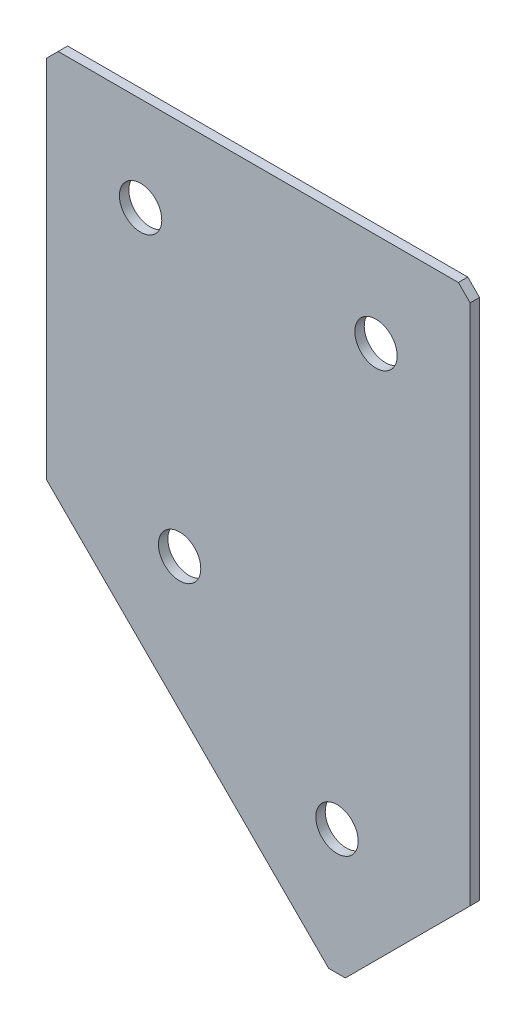
ISO-10303-21;
HEADER;
FILE_DESCRIPTION(('STEP AP214'),'2;1');
FILE_NAME('part.step','',(''),(''),'','','');
FILE_SCHEMA(('AUTOMOTIVE_DESIGN { 1 0 10303 214 1 1 1 1 }'));
ENDSEC;
DATA;
#1=APPLICATION_CONTEXT('core data for automotive mechanical design processes');
#2=APPLICATION_PROTOCOL_DEFINITION('international standard','automotive_design',2000,#1);
#3=PRODUCT_CONTEXT('',#1,'mechanical');
#4=PRODUCT('Part','Part','',(#3));
#5=PRODUCT_RELATED_PRODUCT_CATEGORY('part','',(#4));
#6=PRODUCT_DEFINITION_FORMATION('','',#4);
#7=PRODUCT_DEFINITION_CONTEXT('part definition',#1,'design');
#8=PRODUCT_DEFINITION('design','',#6,#7);
#9=PRODUCT_DEFINITION_SHAPE('','',#8);
#10=(LENGTH_UNIT() NAMED_UNIT(*) SI_UNIT(.MILLI.,.METRE.));
#11=(NAMED_UNIT(*) PLANE_ANGLE_UNIT() SI_UNIT($,.RADIAN.));
#12=(NAMED_UNIT(*) SI_UNIT($,.STERADIAN.) SOLID_ANGLE_UNIT());
#13=UNCERTAINTY_MEASURE_WITH_UNIT(LENGTH_MEASURE(1.E-05),#10,'distance_accuracy_value','');
#14=(GEOMETRIC_REPRESENTATION_CONTEXT(3) GLOBAL_UNCERTAINTY_ASSIGNED_CONTEXT((#13)) GLOBAL_UNIT_ASSIGNED_CONTEXT((#10,
#11,#12)) REPRESENTATION_CONTEXT('',''));
#15=CARTESIAN_POINT('',(0.,0.,0.));
#16=DIRECTION('',(0.,0.,1.));
#17=DIRECTION('',(1.,0.,0.));
#18=AXIS2_PLACEMENT_3D('',#15,#16,#17);
#19=CARTESIAN_POINT('',(0.,0.,-2.));
#20=DIRECTION('',(1.,0.,0.));
#21=DIRECTION('',(0.,0.,-1.));
#22=AXIS2_PLACEMENT_3D('',#19,#20,#21);
#23=PLANE('',#22);
#24=DIRECTION('',(0.,1.,0.));
#25=VECTOR('',#24,1.);
#26=CARTESIAN_POINT('',(0.,0.,0.));
#27=LINE('',#26,#25);
#28=CARTESIAN_POINT('',(0.,-80.,0.));
#29=VERTEX_POINT('',#28);
#30=CARTESIAN_POINT('',(0.,-2.5,0.));
#31=VERTEX_POINT('',#30);
#32=EDGE_CURVE('E137',#29,#31,#27,.T.);
#33=ORIENTED_EDGE('',*,*,#32,.T.);
#34=DIRECTION('',(0.,0.,-1.));
#35=VECTOR('',#34,1.);
#36=CARTESIAN_POINT('',(0.,-2.5,-2.));
#37=LINE('',#36,#35);
#38=CARTESIAN_POINT('',(0.,-2.5,-2.));
#39=VERTEX_POINT('',#38);
#40=EDGE_CURVE('E11',#31,#39,#37,.T.);
#41=ORIENTED_EDGE('',*,*,#40,.T.);
#42=DIRECTION('',(0.,1.,0.));
#43=VECTOR('',#42,1.);
#44=CARTESIAN_POINT('',(0.,0.,-2.));
#45=LINE('',#44,#43);
#46=CARTESIAN_POINT('',(0.,-80.,-2.));
#47=VERTEX_POINT('',#46);
#48=EDGE_CURVE('E153',#47,#39,#45,.T.);
#49=ORIENTED_EDGE('',*,*,#48,.F.);
#50=DIRECTION('',(0.,0.,1.));
#51=VECTOR('',#50,1.);
#52=CARTESIAN_POINT('',(0.,-80.,-2.));
#53=LINE('',#52,#51);
#54=EDGE_CURVE('E125',#47,#29,#53,.T.);
#55=ORIENTED_EDGE('',*,*,#54,.T.);
#56=EDGE_LOOP('',(#33,#41,#49,#55));
#57=FACE_BOUND('',#56,.T.);
#58=ADVANCED_FACE('F39',(#57),#23,.F.);
#59=CARTESIAN_POINT('',(0.,0.,-2.));
#60=DIRECTION('',(0.,-1.,0.));
#61=DIRECTION('',(0.,0.,-1.));
#62=AXIS2_PLACEMENT_3D('',#59,#60,#61);
#63=PLANE('',#62);
#64=DIRECTION('',(1.,0.,0.));
#65=VECTOR('',#64,1.);
#66=CARTESIAN_POINT('',(0.,0.,0.));
#67=LINE('',#66,#65);
#68=CARTESIAN_POINT('',(2.5,0.,0.));
#69=VERTEX_POINT('',#68);
#70=CARTESIAN_POINT('',(87.5,0.,0.));
#71=VERTEX_POINT('',#70);
#72=EDGE_CURVE('E141',#69,#71,#67,.T.);
#73=ORIENTED_EDGE('',*,*,#72,.T.);
#74=DIRECTION('',(0.,0.,-1.));
#75=VECTOR('',#74,1.);
#76=CARTESIAN_POINT('',(87.5,0.,-2.));
#77=LINE('',#76,#75);
#78=CARTESIAN_POINT('',(87.5,0.,-2.));
#79=VERTEX_POINT('',#78);
#80=EDGE_CURVE('E48',#71,#79,#77,.T.);
#81=ORIENTED_EDGE('',*,*,#80,.T.);
#82=DIRECTION('',(1.,0.,0.));
#83=VECTOR('',#82,1.);
#84=CARTESIAN_POINT('',(0.,0.,-2.));
#85=LINE('',#84,#83);
#86=CARTESIAN_POINT('',(2.5,0.,-2.));
#87=VERTEX_POINT('',#86);
#88=EDGE_CURVE('E113',#87,#79,#85,.T.);
#89=ORIENTED_EDGE('',*,*,#88,.F.);
#90=DIRECTION('',(0.,0.,1.));
#91=VECTOR('',#90,1.);
#92=CARTESIAN_POINT('',(2.5,0.,-2.));
#93=LINE('',#92,#91);
#94=EDGE_CURVE('E182',#87,#69,#93,.T.);
#95=ORIENTED_EDGE('',*,*,#94,.T.);
#96=EDGE_LOOP('',(#73,#81,#89,#95));
#97=FACE_BOUND('',#96,.T.);
#98=ADVANCED_FACE('F188',(#97),#63,.F.);
#99=CARTESIAN_POINT('',(90.,0.,-2.));
#100=DIRECTION('',(-1.,0.,0.));
#101=DIRECTION('',(0.,-1.,0.));
#102=AXIS2_PLACEMENT_3D('',#99,#100,#101);
#103=PLANE('',#102);
#104=DIRECTION('',(0.,-1.,0.));
#105=VECTOR('',#104,1.);
#106=CARTESIAN_POINT('',(90.,0.,-2.));
#107=LINE('',#106,#105);
#108=CARTESIAN_POINT('',(90.,-2.50000000000002,-2.));
#109=VERTEX_POINT('',#108);
#110=CARTESIAN_POINT('',(90.0000000000002,-113.431457505077,-2.));
#111=VERTEX_POINT('',#110);
#112=EDGE_CURVE('E103',#109,#111,#107,.T.);
#113=ORIENTED_EDGE('',*,*,#112,.F.);
#114=DIRECTION('',(0.,0.,1.));
#115=VECTOR('',#114,1.);
#116=CARTESIAN_POINT('',(90.,-2.50000000000002,-2.));
#117=LINE('',#116,#115);
#118=CARTESIAN_POINT('',(90.,-2.50000000000002,0.));
#119=VERTEX_POINT('',#118);
#120=EDGE_CURVE('E179',#109,#119,#117,.T.);
#121=ORIENTED_EDGE('',*,*,#120,.T.);
#122=DIRECTION('',(0.,-1.,0.));
#123=VECTOR('',#122,1.);
#124=CARTESIAN_POINT('',(90.,0.,0.));
#125=LINE('',#124,#123);
#126=CARTESIAN_POINT('',(90.0000000000002,-113.431457505077,0.));
#127=VERTEX_POINT('',#126);
#128=EDGE_CURVE('E119',#119,#127,#125,.T.);
#129=ORIENTED_EDGE('',*,*,#128,.T.);
#130=DIRECTION('',(0.,0.,1.));
#131=VECTOR('',#130,1.);
#132=CARTESIAN_POINT('',(90.0000000000002,-113.431457505077,-2.));
#133=LINE('',#132,#131);
#134=EDGE_CURVE('E116',#111,#127,#133,.T.);
#135=ORIENTED_EDGE('',*,*,#134,.F.);
#136=EDGE_LOOP('',(#113,#121,#129,#135));
#137=FACE_BOUND('',#136,.T.);
#138=ADVANCED_FACE('F117',(#137),#103,.F.);
#139=CARTESIAN_POINT('',(61.7157287525382,-141.715728752538,-2.));
#140=DIRECTION('',(-0.707106781186546,0.707106781186549,0.));
#141=DIRECTION('',(-0.707106781186549,-0.707106781186546,0.));
#142=AXIS2_PLACEMENT_3D('',#139,#140,#141);
#143=PLANE('',#142);
#144=DIRECTION('',(-0.707106781186549,-0.707106781186546,0.));
#145=VECTOR('',#144,1.);
#146=CARTESIAN_POINT('',(61.7157287525382,-141.715728752538,0.));
#147=LINE('',#146,#145);
#148=CARTESIAN_POINT('',(63.4834957055046,-139.947961799572,0.));
#149=VERTEX_POINT('',#148);
#150=EDGE_CURVE('E147',#127,#149,#147,.T.);
#151=ORIENTED_EDGE('',*,*,#150,.T.);
#152=DIRECTION('',(0.,0.,-1.));
#153=VECTOR('',#152,1.);
#154=CARTESIAN_POINT('',(63.4834957055046,-139.947961799572,-2.));
#155=LINE('',#154,#153);
#156=CARTESIAN_POINT('',(63.4834957055046,-139.947961799572,-2.));
#157=VERTEX_POINT('',#156);
#158=EDGE_CURVE('E129',#149,#157,#155,.T.);
#159=ORIENTED_EDGE('',*,*,#158,.T.);
#160=DIRECTION('',(-0.707106781186549,-0.707106781186546,0.));
#161=VECTOR('',#160,1.);
#162=CARTESIAN_POINT('',(61.7157287525382,-141.715728752538,-2.));
#163=LINE('',#162,#161);
#164=EDGE_CURVE('E107',#111,#157,#163,.T.);
#165=ORIENTED_EDGE('',*,*,#164,.F.);
#166=ORIENTED_EDGE('',*,*,#134,.T.);
#167=EDGE_LOOP('',(#151,#159,#165,#166));
#168=FACE_BOUND('',#167,.T.);
#169=ADVANCED_FACE('F127',(#168),#143,.F.);
#170=CARTESIAN_POINT('',(0.,-80.,-2.));
#171=DIRECTION('',(0.707106781186549,0.707106781186546,0.));
#172=DIRECTION('',(-0.707106781186546,0.707106781186549,0.));
#173=AXIS2_PLACEMENT_3D('',#170,#171,#172);
#174=PLANE('',#173);
#175=DIRECTION('',(-0.707106781186546,0.707106781186549,0.));
#176=VECTOR('',#175,1.);
#177=CARTESIAN_POINT('',(0.,-80.,-2.));
#178=LINE('',#177,#176);
#179=CARTESIAN_POINT('',(59.9479617995719,-139.947961799572,-2.));
#180=VERTEX_POINT('',#179);
#181=EDGE_CURVE('E131',#180,#47,#178,.T.);
#182=ORIENTED_EDGE('',*,*,#181,.F.);
#183=DIRECTION('',(0.,0.,1.));
#184=VECTOR('',#183,1.);
#185=CARTESIAN_POINT('',(59.9479617995719,-139.947961799572,-2.));
#186=LINE('',#185,#184);
#187=CARTESIAN_POINT('',(59.9479617995719,-139.947961799572,0.));
#188=VERTEX_POINT('',#187);
#189=EDGE_CURVE('E124',#180,#188,#186,.T.);
#190=ORIENTED_EDGE('',*,*,#189,.T.);
#191=DIRECTION('',(-0.707106781186546,0.707106781186549,0.));
#192=VECTOR('',#191,1.);
#193=CARTESIAN_POINT('',(0.,-80.,0.));
#194=LINE('',#193,#192);
#195=EDGE_CURVE('E150',#188,#29,#194,.T.);
#196=ORIENTED_EDGE('',*,*,#195,.T.);
#197=ORIENTED_EDGE('',*,*,#54,.F.);
#198=EDGE_LOOP('',(#182,#190,#196,#197));
#199=FACE_BOUND('',#198,.T.);
#200=ADVANCED_FACE('F218',(#199),#174,.F.);
#201=CARTESIAN_POINT('',(0.,0.,-2.));
#202=DIRECTION('',(0.,0.,1.));
#203=DIRECTION('',(1.,0.,0.));
#204=AXIS2_PLACEMENT_3D('',#201,#202,#203);
#205=PLANE('',#204);
#206=CARTESIAN_POINT('',(70.,-20.,-2.));
#207=DIRECTION('',(0.,0.,-1.));
#208=DIRECTION('',(0.,1.,0.));
#209=AXIS2_PLACEMENT_3D('',#206,#207,#208);
#210=CIRCLE('',#209,4.5);
#211=CARTESIAN_POINT('',(70.,-15.5,-2.));
#212=VERTEX_POINT('',#211);
#213=EDGE_CURVE('E250',#212,#212,#210,.T.);
#214=ORIENTED_EDGE('',*,*,#213,.F.);
#215=EDGE_LOOP('',(#214));
#216=FACE_BOUND('',#215,.T.);
#217=CARTESIAN_POINT('',(28.2842712474619,-80.0000000000002,-2.));
#218=DIRECTION('',(0.,0.,-1.));
#219=DIRECTION('',(0.,1.,0.));
#220=AXIS2_PLACEMENT_3D('',#217,#218,#219);
#221=CIRCLE('',#220,4.5);
#222=CARTESIAN_POINT('',(28.2842712474619,-75.5000000000002,-2.));
#223=VERTEX_POINT('',#222);
#224=EDGE_CURVE('E254',#223,#223,#221,.T.);
#225=ORIENTED_EDGE('',*,*,#224,.F.);
#226=EDGE_LOOP('',(#225));
#227=FACE_BOUND('',#226,.T.);
#228=CARTESIAN_POINT('',(61.7157287525383,-113.431457505077,-2.00000000000001));
#229=DIRECTION('',(0.,0.,-1.));
#230=DIRECTION('',(0.,1.,0.));
#231=AXIS2_PLACEMENT_3D('',#228,#229,#230);
#232=CIRCLE('',#231,4.5);
#233=CARTESIAN_POINT('',(61.7157287525383,-108.931457505077,-2.00000000000001));
#234=VERTEX_POINT('',#233);
#235=EDGE_CURVE('E264',#234,#234,#232,.T.);
#236=ORIENTED_EDGE('',*,*,#235,.F.);
#237=EDGE_LOOP('',(#236));
#238=FACE_BOUND('',#237,.T.);
#239=CARTESIAN_POINT('',(20.,-20.,-2.));
#240=DIRECTION('',(0.,0.,-1.));
#241=DIRECTION('',(0.,1.,0.));
#242=AXIS2_PLACEMENT_3D('',#239,#240,#241);
#243=CIRCLE('',#242,4.5);
#244=CARTESIAN_POINT('',(20.,-15.5,-2.));
#245=VERTEX_POINT('',#244);
#246=EDGE_CURVE('E272',#245,#245,#243,.T.);
#247=ORIENTED_EDGE('',*,*,#246,.F.);
#248=EDGE_LOOP('',(#247));
#249=FACE_BOUND('',#248,.T.);
#250=ORIENTED_EDGE('',*,*,#164,.T.);
#251=DIRECTION('',(1.,0.,0.));
#252=VECTOR('',#251,1.);
#253=CARTESIAN_POINT('',(59.9479617995719,-139.947961799572,-2.));
#254=LINE('',#253,#252);
#255=EDGE_CURVE('E176',#157,#180,#254,.F.);
#256=ORIENTED_EDGE('',*,*,#255,.T.);
#257=ORIENTED_EDGE('',*,*,#181,.T.);
#258=ORIENTED_EDGE('',*,*,#48,.T.);
#259=DIRECTION('',(-0.707106781186548,-0.707106781186548,0.));
#260=VECTOR('',#259,1.);
#261=CARTESIAN_POINT('',(2.5,0.,-2.));
#262=LINE('',#261,#260);
#263=EDGE_CURVE('E171',#39,#87,#262,.F.);
#264=ORIENTED_EDGE('',*,*,#263,.T.);
#265=ORIENTED_EDGE('',*,*,#88,.T.);
#266=DIRECTION('',(-0.707106781186548,0.707106781186548,0.));
#267=VECTOR('',#266,1.);
#268=CARTESIAN_POINT('',(90.,-2.50000000000002,-2.));
#269=LINE('',#268,#267);
#270=EDGE_CURVE('E55',#79,#109,#269,.F.);
#271=ORIENTED_EDGE('',*,*,#270,.T.);
#272=ORIENTED_EDGE('',*,*,#112,.T.);
#273=EDGE_LOOP('',(#250,#256,#257,#258,#264,#265,#271,#272));
#274=FACE_BOUND('',#273,.T.);
#275=ADVANCED_FACE('F105',(#216,#227,#238,#249,#274),#205,.F.);
#276=CARTESIAN_POINT('',(0.,0.,0.));
#277=DIRECTION('',(0.,0.,1.));
#278=DIRECTION('',(1.,0.,0.));
#279=AXIS2_PLACEMENT_3D('',#276,#277,#278);
#280=PLANE('',#279);
#281=CARTESIAN_POINT('',(70.,-20.,0.));
#282=DIRECTION('',(0.,0.,-1.));
#283=DIRECTION('',(0.,1.,0.));
#284=AXIS2_PLACEMENT_3D('',#281,#282,#283);
#285=CIRCLE('',#284,4.5);
#286=CARTESIAN_POINT('',(70.,-15.5,0.));
#287=VERTEX_POINT('',#286);
#288=EDGE_CURVE('E247',#287,#287,#285,.T.);
#289=ORIENTED_EDGE('',*,*,#288,.T.);
#290=EDGE_LOOP('',(#289));
#291=FACE_BOUND('',#290,.T.);
#292=CARTESIAN_POINT('',(28.2842712474619,-80.0000000000002,0.));
#293=DIRECTION('',(0.,0.,-1.));
#294=DIRECTION('',(0.,1.,0.));
#295=AXIS2_PLACEMENT_3D('',#292,#293,#294);
#296=CIRCLE('',#295,4.5);
#297=CARTESIAN_POINT('',(28.2842712474619,-75.5000000000002,0.));
#298=VERTEX_POINT('',#297);
#299=EDGE_CURVE('E260',#298,#298,#296,.T.);
#300=ORIENTED_EDGE('',*,*,#299,.T.);
#301=EDGE_LOOP('',(#300));
#302=FACE_BOUND('',#301,.T.);
#303=CARTESIAN_POINT('',(61.7157287525383,-113.431457505077,0.));
#304=DIRECTION('',(0.,0.,-1.));
#305=DIRECTION('',(0.,1.,0.));
#306=AXIS2_PLACEMENT_3D('',#303,#304,#305);
#307=CIRCLE('',#306,4.5);
#308=CARTESIAN_POINT('',(61.7157287525383,-108.931457505077,0.));
#309=VERTEX_POINT('',#308);
#310=EDGE_CURVE('E268',#309,#309,#307,.T.);
#311=ORIENTED_EDGE('',*,*,#310,.T.);
#312=EDGE_LOOP('',(#311));
#313=FACE_BOUND('',#312,.T.);
#314=CARTESIAN_POINT('',(20.,-20.,0.));
#315=DIRECTION('',(0.,0.,-1.));
#316=DIRECTION('',(0.,1.,0.));
#317=AXIS2_PLACEMENT_3D('',#314,#315,#316);
#318=CIRCLE('',#317,4.5);
#319=CARTESIAN_POINT('',(20.,-15.5,0.));
#320=VERTEX_POINT('',#319);
#321=EDGE_CURVE('E142',#320,#320,#318,.T.);
#322=ORIENTED_EDGE('',*,*,#321,.T.);
#323=EDGE_LOOP('',(#322));
#324=FACE_BOUND('',#323,.T.);
#325=ORIENTED_EDGE('',*,*,#195,.F.);
#326=DIRECTION('',(-1.,0.,0.));
#327=VECTOR('',#326,1.);
#328=CARTESIAN_POINT('',(0.,-139.947961799572,0.));
#329=LINE('',#328,#327);
#330=EDGE_CURVE('E166',#188,#149,#329,.F.);
#331=ORIENTED_EDGE('',*,*,#330,.T.);
#332=ORIENTED_EDGE('',*,*,#150,.F.);
#333=ORIENTED_EDGE('',*,*,#128,.F.);
#334=DIRECTION('',(0.707106781186548,-0.707106781186548,0.));
#335=VECTOR('',#334,1.);
#336=CARTESIAN_POINT('',(43.75,43.75,0.));
#337=LINE('',#336,#335);
#338=EDGE_CURVE('E163',#119,#71,#337,.F.);
#339=ORIENTED_EDGE('',*,*,#338,.T.);
#340=ORIENTED_EDGE('',*,*,#72,.F.);
#341=DIRECTION('',(0.707106781186548,0.707106781186548,0.));
#342=VECTOR('',#341,1.);
#343=CARTESIAN_POINT('',(1.25,-1.25,0.));
#344=LINE('',#343,#342);
#345=EDGE_CURVE('E160',#69,#31,#344,.F.);
#346=ORIENTED_EDGE('',*,*,#345,.T.);
#347=ORIENTED_EDGE('',*,*,#32,.F.);
#348=EDGE_LOOP('',(#325,#331,#332,#333,#339,#340,#346,#347));
#349=FACE_BOUND('',#348,.T.);
#350=ADVANCED_FACE('F193',(#291,#302,#313,#324,#349),#280,.T.);
#351=CARTESIAN_POINT('',(20.,-20.,-2.));
#352=DIRECTION('',(0.,0.,-1.));
#353=DIRECTION('',(0.,1.,0.));
#354=AXIS2_PLACEMENT_3D('',#351,#352,#353);
#355=CYLINDRICAL_SURFACE('',#354,4.5);
#356=ORIENTED_EDGE('',*,*,#321,.F.);
#357=EDGE_LOOP('',(#356));
#358=FACE_BOUND('',#357,.T.);
#359=ORIENTED_EDGE('',*,*,#246,.T.);
#360=EDGE_LOOP('',(#359));
#361=FACE_BOUND('',#360,.T.);
#362=ADVANCED_FACE('F224',(#358,#361),#355,.F.);
#363=CARTESIAN_POINT('',(61.7157287525383,-113.431457505077,-2.00000000000001));
#364=DIRECTION('',(0.,0.,-1.));
#365=DIRECTION('',(0.,1.,0.));
#366=AXIS2_PLACEMENT_3D('',#363,#364,#365);
#367=CYLINDRICAL_SURFACE('',#366,4.5);
#368=ORIENTED_EDGE('',*,*,#310,.F.);
#369=EDGE_LOOP('',(#368));
#370=FACE_BOUND('',#369,.T.);
#371=ORIENTED_EDGE('',*,*,#235,.T.);
#372=EDGE_LOOP('',(#371));
#373=FACE_BOUND('',#372,.T.);
#374=ADVANCED_FACE('F231',(#370,#373),#367,.F.);
#375=CARTESIAN_POINT('',(28.2842712474619,-80.0000000000002,-2.));
#376=DIRECTION('',(0.,0.,-1.));
#377=DIRECTION('',(0.,1.,0.));
#378=AXIS2_PLACEMENT_3D('',#375,#376,#377);
#379=CYLINDRICAL_SURFACE('',#378,4.5);
#380=ORIENTED_EDGE('',*,*,#299,.F.);
#381=EDGE_LOOP('',(#380));
#382=FACE_BOUND('',#381,.T.);
#383=ORIENTED_EDGE('',*,*,#224,.T.);
#384=EDGE_LOOP('',(#383));
#385=FACE_BOUND('',#384,.T.);
#386=ADVANCED_FACE('F235',(#382,#385),#379,.F.);
#387=CARTESIAN_POINT('',(70.,-20.,-2.));
#388=DIRECTION('',(0.,0.,-1.));
#389=DIRECTION('',(0.,1.,0.));
#390=AXIS2_PLACEMENT_3D('',#387,#388,#389);
#391=CYLINDRICAL_SURFACE('',#390,4.5);
#392=ORIENTED_EDGE('',*,*,#288,.F.);
#393=EDGE_LOOP('',(#392));
#394=FACE_BOUND('',#393,.T.);
#395=ORIENTED_EDGE('',*,*,#213,.T.);
#396=EDGE_LOOP('',(#395));
#397=FACE_BOUND('',#396,.T.);
#398=ADVANCED_FACE('F203',(#394,#397),#391,.F.);
#399=CARTESIAN_POINT('',(59.9479617995719,-139.947961799572,-2.));
#400=DIRECTION('',(0.,1.,0.));
#401=DIRECTION('',(0.,0.,1.));
#402=AXIS2_PLACEMENT_3D('',#399,#400,#401);
#403=PLANE('',#402);
#404=ORIENTED_EDGE('',*,*,#255,.F.);
#405=ORIENTED_EDGE('',*,*,#158,.F.);
#406=ORIENTED_EDGE('',*,*,#330,.F.);
#407=ORIENTED_EDGE('',*,*,#189,.F.);
#408=EDGE_LOOP('',(#404,#405,#406,#407));
#409=FACE_BOUND('',#408,.T.);
#410=ADVANCED_FACE('F198',(#409),#403,.F.);
#411=CARTESIAN_POINT('',(90.,-2.50000000000002,-2.));
#412=DIRECTION('',(-0.707106781186547,-0.707106781186547,0.));
#413=DIRECTION('',(0.,0.,1.));
#414=AXIS2_PLACEMENT_3D('',#411,#412,#413);
#415=PLANE('',#414);
#416=ORIENTED_EDGE('',*,*,#270,.F.);
#417=ORIENTED_EDGE('',*,*,#80,.F.);
#418=ORIENTED_EDGE('',*,*,#338,.F.);
#419=ORIENTED_EDGE('',*,*,#120,.F.);
#420=EDGE_LOOP('',(#416,#417,#418,#419));
#421=FACE_BOUND('',#420,.T.);
#422=ADVANCED_FACE('F196',(#421),#415,.F.);
#423=CARTESIAN_POINT('',(2.5,0.,-2.));
#424=DIRECTION('',(0.707106781186547,-0.707106781186547,0.));
#425=DIRECTION('',(0.,0.,1.));
#426=AXIS2_PLACEMENT_3D('',#423,#424,#425);
#427=PLANE('',#426);
#428=ORIENTED_EDGE('',*,*,#263,.F.);
#429=ORIENTED_EDGE('',*,*,#40,.F.);
#430=ORIENTED_EDGE('',*,*,#345,.F.);
#431=ORIENTED_EDGE('',*,*,#94,.F.);
#432=EDGE_LOOP('',(#428,#429,#430,#431));
#433=FACE_BOUND('',#432,.T.);
#434=ADVANCED_FACE('F41',(#433),#427,.F.);
#435=CLOSED_SHELL('',(#58,#98,#138,#169,#200,#275,#350,#362,#374,#386,#398,#410,#422,#434));
#436=MANIFOLD_SOLID_BREP('B2',#435);
#437=ADVANCED_BREP_SHAPE_REPRESENTATION('',(#18,#436),#14);
#438=SHAPE_DEFINITION_REPRESENTATION(#9,#437);
ENDSEC;
END-ISO-10303-21;
